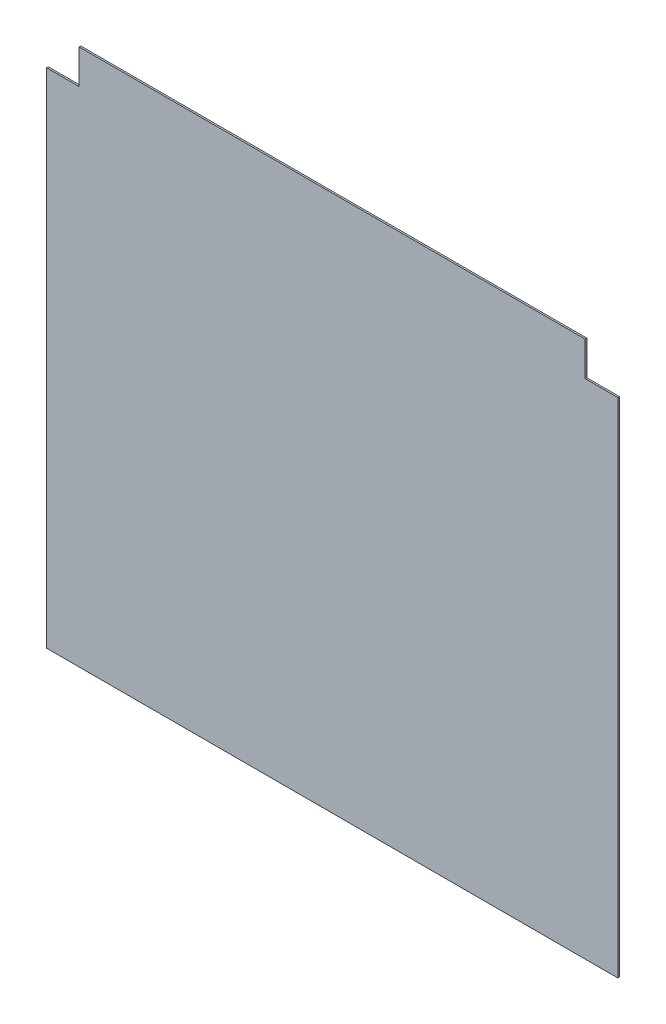
ISO-10303-21;
HEADER;
FILE_DESCRIPTION(('STEP AP214'),'2;1');
FILE_NAME('part.step','',(''),(''),'','','');
FILE_SCHEMA(('AUTOMOTIVE_DESIGN { 1 0 10303 214 1 1 1 1 }'));
ENDSEC;
DATA;
#1=APPLICATION_CONTEXT('core data for automotive mechanical design processes');
#2=APPLICATION_PROTOCOL_DEFINITION('international standard','automotive_design',2000,#1);
#3=PRODUCT_CONTEXT('',#1,'mechanical');
#4=PRODUCT('Part','Part','',(#3));
#5=PRODUCT_RELATED_PRODUCT_CATEGORY('part','',(#4));
#6=PRODUCT_DEFINITION_FORMATION('','',#4);
#7=PRODUCT_DEFINITION_CONTEXT('part definition',#1,'design');
#8=PRODUCT_DEFINITION('design','',#6,#7);
#9=PRODUCT_DEFINITION_SHAPE('','',#8);
#10=(LENGTH_UNIT() NAMED_UNIT(*) SI_UNIT(.MILLI.,.METRE.));
#11=(NAMED_UNIT(*) PLANE_ANGLE_UNIT() SI_UNIT($,.RADIAN.));
#12=(NAMED_UNIT(*) SI_UNIT($,.STERADIAN.) SOLID_ANGLE_UNIT());
#13=UNCERTAINTY_MEASURE_WITH_UNIT(LENGTH_MEASURE(1.E-05),#10,'distance_accuracy_value','');
#14=(GEOMETRIC_REPRESENTATION_CONTEXT(3) GLOBAL_UNCERTAINTY_ASSIGNED_CONTEXT((#13)) GLOBAL_UNIT_ASSIGNED_CONTEXT((#10,
#11,#12)) REPRESENTATION_CONTEXT('',''));
#15=CARTESIAN_POINT('',(0.,0.,0.));
#16=DIRECTION('',(0.,0.,1.));
#17=DIRECTION('',(1.,0.,0.));
#18=AXIS2_PLACEMENT_3D('',#15,#16,#17);
#19=CARTESIAN_POINT('',(330.,308.,1.));
#20=DIRECTION('',(-1.,0.,0.));
#21=DIRECTION('',(0.,0.,1.));
#22=AXIS2_PLACEMENT_3D('',#19,#20,#21);
#23=PLANE('',#22);
#24=DIRECTION('',(0.,1.,0.));
#25=VECTOR('',#24,1.);
#26=CARTESIAN_POINT('',(330.,308.,0.));
#27=LINE('',#26,#25);
#28=CARTESIAN_POINT('',(330.,308.,0.));
#29=VERTEX_POINT('',#28);
#30=CARTESIAN_POINT('',(330.,329.,0.));
#31=VERTEX_POINT('',#30);
#32=EDGE_CURVE('E129',#29,#31,#27,.T.);
#33=ORIENTED_EDGE('',*,*,#32,.T.);
#34=DIRECTION('',(0.,0.,-1.));
#35=VECTOR('',#34,1.);
#36=CARTESIAN_POINT('',(330.,329.,1.));
#37=LINE('',#36,#35);
#38=CARTESIAN_POINT('',(330.,329.,1.));
#39=VERTEX_POINT('',#38);
#40=EDGE_CURVE('E11',#39,#31,#37,.T.);
#41=ORIENTED_EDGE('',*,*,#40,.F.);
#42=DIRECTION('',(0.,1.,0.));
#43=VECTOR('',#42,1.);
#44=CARTESIAN_POINT('',(330.,308.,1.));
#45=LINE('',#44,#43);
#46=CARTESIAN_POINT('',(330.,308.,1.));
#47=VERTEX_POINT('',#46);
#48=EDGE_CURVE('E143',#47,#39,#45,.T.);
#49=ORIENTED_EDGE('',*,*,#48,.F.);
#50=DIRECTION('',(0.,0.,-1.));
#51=VECTOR('',#50,1.);
#52=CARTESIAN_POINT('',(330.,308.,1.));
#53=LINE('',#52,#51);
#54=EDGE_CURVE('E125',#47,#29,#53,.T.);
#55=ORIENTED_EDGE('',*,*,#54,.T.);
#56=EDGE_LOOP('',(#33,#41,#49,#55));
#57=FACE_BOUND('',#56,.T.);
#58=ADVANCED_FACE('F33',(#57),#23,.F.);
#59=CARTESIAN_POINT('',(330.,329.,1.));
#60=DIRECTION('',(0.,-1.,0.));
#61=DIRECTION('',(1.,0.,0.));
#62=AXIS2_PLACEMENT_3D('',#59,#60,#61);
#63=PLANE('',#62);
#64=DIRECTION('',(-1.,0.,0.));
#65=VECTOR('',#64,1.);
#66=CARTESIAN_POINT('',(330.,329.,0.));
#67=LINE('',#66,#65);
#68=CARTESIAN_POINT('',(20.,329.,0.));
#69=VERTEX_POINT('',#68);
#70=EDGE_CURVE('E132',#31,#69,#67,.T.);
#71=ORIENTED_EDGE('',*,*,#70,.T.);
#72=DIRECTION('',(0.,0.,-1.));
#73=VECTOR('',#72,1.);
#74=CARTESIAN_POINT('',(20.,329.,1.));
#75=LINE('',#74,#73);
#76=CARTESIAN_POINT('',(20.,329.,1.));
#77=VERTEX_POINT('',#76);
#78=EDGE_CURVE('E41',#77,#69,#75,.T.);
#79=ORIENTED_EDGE('',*,*,#78,.F.);
#80=DIRECTION('',(-1.,0.,0.));
#81=VECTOR('',#80,1.);
#82=CARTESIAN_POINT('',(330.,329.,1.));
#83=LINE('',#82,#81);
#84=EDGE_CURVE('E92',#39,#77,#83,.T.);
#85=ORIENTED_EDGE('',*,*,#84,.F.);
#86=ORIENTED_EDGE('',*,*,#40,.T.);
#87=EDGE_LOOP('',(#71,#79,#85,#86));
#88=FACE_BOUND('',#87,.T.);
#89=ADVANCED_FACE('F178',(#88),#63,.F.);
#90=CARTESIAN_POINT('',(20.,329.,1.));
#91=DIRECTION('',(1.,0.,0.));
#92=DIRECTION('',(0.,0.,-1.));
#93=AXIS2_PLACEMENT_3D('',#90,#91,#92);
#94=PLANE('',#93);
#95=DIRECTION('',(0.,-1.,0.));
#96=VECTOR('',#95,1.);
#97=CARTESIAN_POINT('',(20.,329.,0.));
#98=LINE('',#97,#96);
#99=CARTESIAN_POINT('',(20.,308.,0.));
#100=VERTEX_POINT('',#99);
#101=EDGE_CURVE('E134',#69,#100,#98,.T.);
#102=ORIENTED_EDGE('',*,*,#101,.T.);
#103=DIRECTION('',(0.,0.,-1.));
#104=VECTOR('',#103,1.);
#105=CARTESIAN_POINT('',(20.,308.,1.));
#106=LINE('',#105,#104);
#107=CARTESIAN_POINT('',(20.,308.,1.));
#108=VERTEX_POINT('',#107);
#109=EDGE_CURVE('E150',#108,#100,#106,.T.);
#110=ORIENTED_EDGE('',*,*,#109,.F.);
#111=DIRECTION('',(0.,-1.,0.));
#112=VECTOR('',#111,1.);
#113=CARTESIAN_POINT('',(20.,329.,1.));
#114=LINE('',#113,#112);
#115=EDGE_CURVE('E158',#77,#108,#114,.T.);
#116=ORIENTED_EDGE('',*,*,#115,.F.);
#117=ORIENTED_EDGE('',*,*,#78,.T.);
#118=EDGE_LOOP('',(#102,#110,#116,#117));
#119=FACE_BOUND('',#118,.T.);
#120=ADVANCED_FACE('F156',(#119),#94,.F.);
#121=CARTESIAN_POINT('',(20.,308.,1.));
#122=DIRECTION('',(0.,-1.,0.));
#123=DIRECTION('',(0.,0.,-1.));
#124=AXIS2_PLACEMENT_3D('',#121,#122,#123);
#125=PLANE('',#124);
#126=DIRECTION('',(-1.,0.,0.));
#127=VECTOR('',#126,1.);
#128=CARTESIAN_POINT('',(20.,308.,0.));
#129=LINE('',#128,#127);
#130=CARTESIAN_POINT('',(0.,308.,0.));
#131=VERTEX_POINT('',#130);
#132=EDGE_CURVE('E136',#100,#131,#129,.T.);
#133=ORIENTED_EDGE('',*,*,#132,.T.);
#134=DIRECTION('',(0.,0.,-1.));
#135=VECTOR('',#134,1.);
#136=CARTESIAN_POINT('',(0.,308.,1.));
#137=LINE('',#136,#135);
#138=CARTESIAN_POINT('',(0.,308.,1.));
#139=VERTEX_POINT('',#138);
#140=EDGE_CURVE('E147',#139,#131,#137,.T.);
#141=ORIENTED_EDGE('',*,*,#140,.F.);
#142=DIRECTION('',(-1.,0.,0.));
#143=VECTOR('',#142,1.);
#144=CARTESIAN_POINT('',(20.,308.,1.));
#145=LINE('',#144,#143);
#146=EDGE_CURVE('E170',#108,#139,#145,.T.);
#147=ORIENTED_EDGE('',*,*,#146,.F.);
#148=ORIENTED_EDGE('',*,*,#109,.T.);
#149=EDGE_LOOP('',(#133,#141,#147,#148));
#150=FACE_BOUND('',#149,.T.);
#151=ADVANCED_FACE('F166',(#150),#125,.F.);
#152=CARTESIAN_POINT('',(0.,308.,1.));
#153=DIRECTION('',(1.,0.,0.));
#154=DIRECTION('',(0.,1.,0.));
#155=AXIS2_PLACEMENT_3D('',#152,#153,#154);
#156=PLANE('',#155);
#157=DIRECTION('',(0.,-1.,0.));
#158=VECTOR('',#157,1.);
#159=CARTESIAN_POINT('',(0.,308.,0.));
#160=LINE('',#159,#158);
#161=CARTESIAN_POINT('',(0.,0.,0.));
#162=VERTEX_POINT('',#161);
#163=EDGE_CURVE('E138',#131,#162,#160,.T.);
#164=ORIENTED_EDGE('',*,*,#163,.T.);
#165=DIRECTION('',(0.,0.,-1.));
#166=VECTOR('',#165,1.);
#167=CARTESIAN_POINT('',(0.,0.,1.));
#168=LINE('',#167,#166);
#169=CARTESIAN_POINT('',(0.,0.,1.));
#170=VERTEX_POINT('',#169);
#171=EDGE_CURVE('E120',#170,#162,#168,.T.);
#172=ORIENTED_EDGE('',*,*,#171,.F.);
#173=DIRECTION('',(0.,-1.,0.));
#174=VECTOR('',#173,1.);
#175=CARTESIAN_POINT('',(0.,308.,1.));
#176=LINE('',#175,#174);
#177=EDGE_CURVE('E111',#139,#170,#176,.T.);
#178=ORIENTED_EDGE('',*,*,#177,.F.);
#179=ORIENTED_EDGE('',*,*,#140,.T.);
#180=EDGE_LOOP('',(#164,#172,#178,#179));
#181=FACE_BOUND('',#180,.T.);
#182=ADVANCED_FACE('F169',(#181),#156,.F.);
#183=CARTESIAN_POINT('',(0.,0.,1.));
#184=DIRECTION('',(0.,1.,0.));
#185=DIRECTION('',(0.,0.,1.));
#186=AXIS2_PLACEMENT_3D('',#183,#184,#185);
#187=PLANE('',#186);
#188=DIRECTION('',(1.,0.,0.));
#189=VECTOR('',#188,1.);
#190=CARTESIAN_POINT('',(0.,0.,0.));
#191=LINE('',#190,#189);
#192=CARTESIAN_POINT('',(350.,0.,0.));
#193=VERTEX_POINT('',#192);
#194=EDGE_CURVE('E119',#162,#193,#191,.T.);
#195=ORIENTED_EDGE('',*,*,#194,.T.);
#196=DIRECTION('',(0.,0.,-1.));
#197=VECTOR('',#196,1.);
#198=CARTESIAN_POINT('',(350.,0.,1.));
#199=LINE('',#198,#197);
#200=CARTESIAN_POINT('',(350.,0.,1.));
#201=VERTEX_POINT('',#200);
#202=EDGE_CURVE('E116',#201,#193,#199,.T.);
#203=ORIENTED_EDGE('',*,*,#202,.F.);
#204=DIRECTION('',(1.,0.,0.));
#205=VECTOR('',#204,1.);
#206=CARTESIAN_POINT('',(0.,0.,1.));
#207=LINE('',#206,#205);
#208=EDGE_CURVE('E105',#170,#201,#207,.T.);
#209=ORIENTED_EDGE('',*,*,#208,.F.);
#210=ORIENTED_EDGE('',*,*,#171,.T.);
#211=EDGE_LOOP('',(#195,#203,#209,#210));
#212=FACE_BOUND('',#211,.T.);
#213=ADVANCED_FACE('F117',(#212),#187,.F.);
#214=CARTESIAN_POINT('',(350.,0.,1.));
#215=DIRECTION('',(-1.,0.,0.));
#216=DIRECTION('',(0.,0.,1.));
#217=AXIS2_PLACEMENT_3D('',#214,#215,#216);
#218=PLANE('',#217);
#219=DIRECTION('',(0.,1.,0.));
#220=VECTOR('',#219,1.);
#221=CARTESIAN_POINT('',(350.,0.,0.));
#222=LINE('',#221,#220);
#223=CARTESIAN_POINT('',(350.,308.,0.));
#224=VERTEX_POINT('',#223);
#225=EDGE_CURVE('E78',#193,#224,#222,.T.);
#226=ORIENTED_EDGE('',*,*,#225,.T.);
#227=DIRECTION('',(0.,0.,-1.));
#228=VECTOR('',#227,1.);
#229=CARTESIAN_POINT('',(350.,308.,1.));
#230=LINE('',#229,#228);
#231=CARTESIAN_POINT('',(350.,308.,1.));
#232=VERTEX_POINT('',#231);
#233=EDGE_CURVE('E121',#232,#224,#230,.T.);
#234=ORIENTED_EDGE('',*,*,#233,.F.);
#235=DIRECTION('',(0.,1.,0.));
#236=VECTOR('',#235,1.);
#237=CARTESIAN_POINT('',(350.,0.,1.));
#238=LINE('',#237,#236);
#239=EDGE_CURVE('E109',#201,#232,#238,.T.);
#240=ORIENTED_EDGE('',*,*,#239,.F.);
#241=ORIENTED_EDGE('',*,*,#202,.T.);
#242=EDGE_LOOP('',(#226,#234,#240,#241));
#243=FACE_BOUND('',#242,.T.);
#244=ADVANCED_FACE('F123',(#243),#218,.F.);
#245=CARTESIAN_POINT('',(350.,308.,1.));
#246=DIRECTION('',(0.,-1.,0.));
#247=DIRECTION('',(0.,0.,-1.));
#248=AXIS2_PLACEMENT_3D('',#245,#246,#247);
#249=PLANE('',#248);
#250=DIRECTION('',(-1.,0.,0.));
#251=VECTOR('',#250,1.);
#252=CARTESIAN_POINT('',(350.,308.,0.));
#253=LINE('',#252,#251);
#254=EDGE_CURVE('E84',#224,#29,#253,.T.);
#255=ORIENTED_EDGE('',*,*,#254,.T.);
#256=ORIENTED_EDGE('',*,*,#54,.F.);
#257=DIRECTION('',(-1.,0.,0.));
#258=VECTOR('',#257,1.);
#259=CARTESIAN_POINT('',(350.,308.,1.));
#260=LINE('',#259,#258);
#261=EDGE_CURVE('E49',#232,#47,#260,.T.);
#262=ORIENTED_EDGE('',*,*,#261,.F.);
#263=ORIENTED_EDGE('',*,*,#233,.T.);
#264=EDGE_LOOP('',(#255,#256,#262,#263));
#265=FACE_BOUND('',#264,.T.);
#266=ADVANCED_FACE('F194',(#265),#249,.F.);
#267=CARTESIAN_POINT('',(0.,0.,1.));
#268=DIRECTION('',(0.,0.,1.));
#269=DIRECTION('',(1.,0.,0.));
#270=AXIS2_PLACEMENT_3D('',#267,#268,#269);
#271=PLANE('',#270);
#272=ORIENTED_EDGE('',*,*,#48,.T.);
#273=ORIENTED_EDGE('',*,*,#84,.T.);
#274=ORIENTED_EDGE('',*,*,#115,.T.);
#275=ORIENTED_EDGE('',*,*,#146,.T.);
#276=ORIENTED_EDGE('',*,*,#177,.T.);
#277=ORIENTED_EDGE('',*,*,#208,.T.);
#278=ORIENTED_EDGE('',*,*,#239,.T.);
#279=ORIENTED_EDGE('',*,*,#261,.T.);
#280=EDGE_LOOP('',(#272,#273,#274,#275,#276,#277,#278,#279));
#281=FACE_BOUND('',#280,.T.);
#282=ADVANCED_FACE('F107',(#281),#271,.T.);
#283=CARTESIAN_POINT('',(0.,0.,0.));
#284=DIRECTION('',(0.,0.,1.));
#285=DIRECTION('',(1.,0.,0.));
#286=AXIS2_PLACEMENT_3D('',#283,#284,#285);
#287=PLANE('',#286);
#288=ORIENTED_EDGE('',*,*,#32,.F.);
#289=ORIENTED_EDGE('',*,*,#254,.F.);
#290=ORIENTED_EDGE('',*,*,#225,.F.);
#291=ORIENTED_EDGE('',*,*,#194,.F.);
#292=ORIENTED_EDGE('',*,*,#163,.F.);
#293=ORIENTED_EDGE('',*,*,#132,.F.);
#294=ORIENTED_EDGE('',*,*,#101,.F.);
#295=ORIENTED_EDGE('',*,*,#70,.F.);
#296=EDGE_LOOP('',(#288,#289,#290,#291,#292,#293,#294,#295));
#297=FACE_BOUND('',#296,.T.);
#298=ADVANCED_FACE('F162',(#297),#287,.F.);
#299=CLOSED_SHELL('',(#58,#89,#120,#151,#182,#213,#244,#266,#282,#298));
#300=MANIFOLD_SOLID_BREP('B2',#299);
#301=ADVANCED_BREP_SHAPE_REPRESENTATION('',(#18,#300),#14);
#302=SHAPE_DEFINITION_REPRESENTATION(#9,#301);
ENDSEC;
END-ISO-10303-21;
